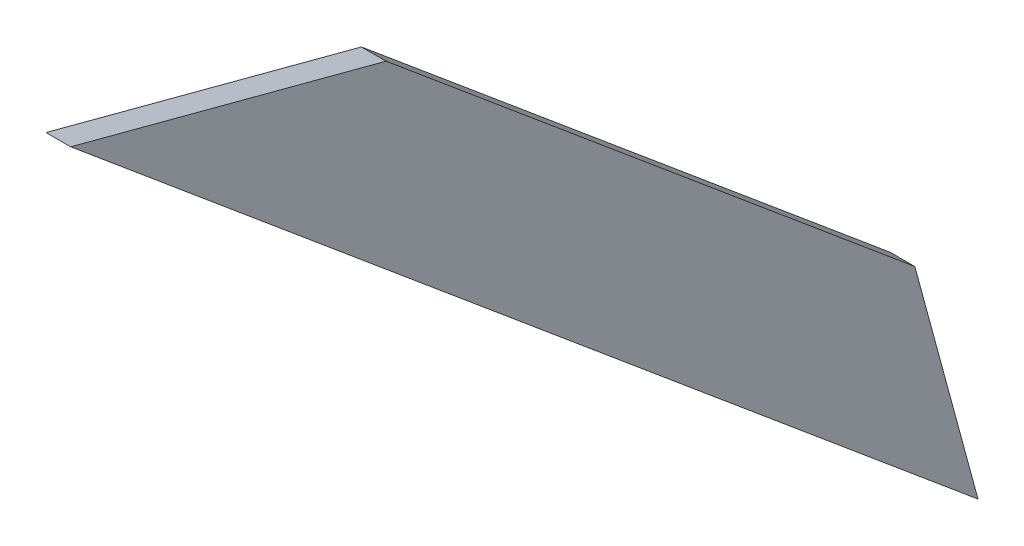
ISO-10303-21;
HEADER;
FILE_DESCRIPTION(('STEP AP214'),'2;1');
FILE_NAME('part.step','',(''),(''),'','','');
FILE_SCHEMA(('AUTOMOTIVE_DESIGN { 1 0 10303 214 1 1 1 1 }'));
ENDSEC;
DATA;
#1=APPLICATION_CONTEXT('core data for automotive mechanical design processes');
#2=APPLICATION_PROTOCOL_DEFINITION('international standard','automotive_design',2000,#1);
#3=PRODUCT_CONTEXT('',#1,'mechanical');
#4=PRODUCT('Part','Part','',(#3));
#5=PRODUCT_RELATED_PRODUCT_CATEGORY('part','',(#4));
#6=PRODUCT_DEFINITION_FORMATION('','',#4);
#7=PRODUCT_DEFINITION_CONTEXT('part definition',#1,'design');
#8=PRODUCT_DEFINITION('design','',#6,#7);
#9=PRODUCT_DEFINITION_SHAPE('','',#8);
#10=(LENGTH_UNIT() NAMED_UNIT(*) SI_UNIT(.MILLI.,.METRE.));
#11=(NAMED_UNIT(*) PLANE_ANGLE_UNIT() SI_UNIT($,.RADIAN.));
#12=(NAMED_UNIT(*) SI_UNIT($,.STERADIAN.) SOLID_ANGLE_UNIT());
#13=UNCERTAINTY_MEASURE_WITH_UNIT(LENGTH_MEASURE(1.E-05),#10,'distance_accuracy_value','');
#14=(GEOMETRIC_REPRESENTATION_CONTEXT(3) GLOBAL_UNCERTAINTY_ASSIGNED_CONTEXT((#13)) GLOBAL_UNIT_ASSIGNED_CONTEXT((#10,
#11,#12)) REPRESENTATION_CONTEXT('',''));
#15=CARTESIAN_POINT('',(0.,0.,0.));
#16=DIRECTION('',(0.,0.,1.));
#17=DIRECTION('',(1.,0.,0.));
#18=AXIS2_PLACEMENT_3D('',#15,#16,#17);
#19=CARTESIAN_POINT('',(-12.6622448824479,250.643987544878,583.742363785169));
#20=DIRECTION('',(0.,0.261586153001389,-0.965180130627405));
#21=DIRECTION('',(0.,0.965180130627405,0.261586153001389));
#22=AXIS2_PLACEMENT_3D('',#19,#20,#21);
#23=PLANE('',#22);
#24=DIRECTION('',(0.,-0.965180130627405,-0.261586153001389));
#25=VECTOR('',#24,1.);
#26=CARTESIAN_POINT('',(-17.6622448824479,250.643987544878,583.742363785169));
#27=LINE('',#26,#25);
#28=CARTESIAN_POINT('',(-17.6622448824479,297.840110343666,596.533605344909));
#29=VERTEX_POINT('',#28);
#30=CARTESIAN_POINT('',(-17.6622448824479,250.643987544878,583.742363785169));
#31=VERTEX_POINT('',#30);
#32=EDGE_CURVE('E97',#29,#31,#27,.T.);
#33=ORIENTED_EDGE('',*,*,#32,.F.);
#34=DIRECTION('',(-1.,0.,0.));
#35=VECTOR('',#34,1.);
#36=CARTESIAN_POINT('',(-12.6622448824479,297.840110343666,596.533605344909));
#37=LINE('',#36,#35);
#38=CARTESIAN_POINT('',(-12.6622448824479,297.840110343666,596.533605344909));
#39=VERTEX_POINT('',#38);
#40=EDGE_CURVE('E11',#39,#29,#37,.T.);
#41=ORIENTED_EDGE('',*,*,#40,.F.);
#42=DIRECTION('',(0.,-0.965180130627405,-0.261586153001389));
#43=VECTOR('',#42,1.);
#44=CARTESIAN_POINT('',(-12.6622448824479,250.643987544878,583.742363785169));
#45=LINE('',#44,#43);
#46=CARTESIAN_POINT('',(-12.6622448824479,250.643987544878,583.742363785169));
#47=VERTEX_POINT('',#46);
#48=EDGE_CURVE('E91',#39,#47,#45,.T.);
#49=ORIENTED_EDGE('',*,*,#48,.T.);
#50=DIRECTION('',(-1.,0.,0.));
#51=VECTOR('',#50,1.);
#52=CARTESIAN_POINT('',(-12.6622448824479,250.643987544878,583.742363785169));
#53=LINE('',#52,#51);
#54=EDGE_CURVE('E36',#47,#31,#53,.T.);
#55=ORIENTED_EDGE('',*,*,#54,.T.);
#56=EDGE_LOOP('',(#33,#41,#49,#55));
#57=FACE_BOUND('',#56,.T.);
#58=ADVANCED_FACE('F33',(#57),#23,.T.);
#59=CARTESIAN_POINT('',(-12.6622448824479,297.840110343666,596.533605344909));
#60=DIRECTION('',(0.,0.767128611531678,-0.641493330728761));
#61=DIRECTION('',(0.,0.641493330728761,0.767128611531678));
#62=AXIS2_PLACEMENT_3D('',#59,#60,#61);
#63=PLANE('',#62);
#64=DIRECTION('',(0.,-0.641493330728761,-0.767128611531678));
#65=VECTOR('',#64,1.);
#66=CARTESIAN_POINT('',(-17.6622448824479,297.840110343666,596.533605344909));
#67=LINE('',#66,#65);
#68=CARTESIAN_POINT('',(-17.6622448824479,387.401634034338,703.635587585995));
#69=VERTEX_POINT('',#68);
#70=EDGE_CURVE('E93',#69,#29,#67,.T.);
#71=ORIENTED_EDGE('',*,*,#70,.F.);
#72=DIRECTION('',(-1.,0.,0.));
#73=VECTOR('',#72,1.);
#74=CARTESIAN_POINT('',(-12.6622448824479,387.401634034338,703.635587585995));
#75=LINE('',#74,#73);
#76=CARTESIAN_POINT('',(-12.6622448824479,387.401634034338,703.635587585995));
#77=VERTEX_POINT('',#76);
#78=EDGE_CURVE('E42',#77,#69,#75,.T.);
#79=ORIENTED_EDGE('',*,*,#78,.F.);
#80=DIRECTION('',(0.,-0.641493330728761,-0.767128611531678));
#81=VECTOR('',#80,1.);
#82=CARTESIAN_POINT('',(-12.6622448824479,297.840110343666,596.533605344909));
#83=LINE('',#82,#81);
#84=EDGE_CURVE('E88',#77,#39,#83,.T.);
#85=ORIENTED_EDGE('',*,*,#84,.T.);
#86=ORIENTED_EDGE('',*,*,#40,.T.);
#87=EDGE_LOOP('',(#71,#79,#85,#86));
#88=FACE_BOUND('',#87,.T.);
#89=ADVANCED_FACE('F107',(#88),#63,.T.);
#90=CARTESIAN_POINT('',(-12.6622448824479,404.323150916461,767.519306695337));
#91=DIRECTION('',(0.,0.966663588852357,-0.256049811534946));
#92=DIRECTION('',(0.,0.256049811534946,0.966663588852357));
#93=AXIS2_PLACEMENT_3D('',#90,#91,#92);
#94=PLANE('',#93);
#95=DIRECTION('',(0.,-0.256049811534946,-0.966663588852357));
#96=VECTOR('',#95,1.);
#97=CARTESIAN_POINT('',(-17.6622448824479,404.323150916461,767.519306695337));
#98=LINE('',#97,#96);
#99=CARTESIAN_POINT('',(-17.6622448824479,404.323150916461,767.519306695337));
#100=VERTEX_POINT('',#99);
#101=EDGE_CURVE('E83',#100,#69,#98,.T.);
#102=ORIENTED_EDGE('',*,*,#101,.F.);
#103=DIRECTION('',(-1.,0.,0.));
#104=VECTOR('',#103,1.);
#105=CARTESIAN_POINT('',(-12.6622448824479,404.323150916461,767.519306695337));
#106=LINE('',#105,#104);
#107=CARTESIAN_POINT('',(-12.6622448824479,404.323150916461,767.519306695337));
#108=VERTEX_POINT('',#107);
#109=EDGE_CURVE('E78',#108,#100,#106,.T.);
#110=ORIENTED_EDGE('',*,*,#109,.F.);
#111=DIRECTION('',(0.,-0.256049811534946,-0.966663588852357));
#112=VECTOR('',#111,1.);
#113=CARTESIAN_POINT('',(-12.6622448824479,404.323150916461,767.519306695337));
#114=LINE('',#113,#112);
#115=EDGE_CURVE('E81',#108,#77,#114,.T.);
#116=ORIENTED_EDGE('',*,*,#115,.T.);
#117=ORIENTED_EDGE('',*,*,#78,.T.);
#118=EDGE_LOOP('',(#102,#110,#116,#117));
#119=FACE_BOUND('',#118,.T.);
#120=ADVANCED_FACE('F80',(#119),#94,.T.);
#121=CARTESIAN_POINT('',(-12.6622448824479,250.643987544878,583.742363785169));
#122=DIRECTION('',(0.,-0.767128611531678,0.641493330728761));
#123=DIRECTION('',(0.,-0.641493330728761,-0.767128611531678));
#124=AXIS2_PLACEMENT_3D('',#121,#122,#123);
#125=PLANE('',#124);
#126=DIRECTION('',(0.,0.641493330728761,0.767128611531678));
#127=VECTOR('',#126,1.);
#128=CARTESIAN_POINT('',(-17.6622448824479,250.643987544878,583.742363785169));
#129=LINE('',#128,#127);
#130=EDGE_CURVE('E100',#31,#100,#129,.T.);
#131=ORIENTED_EDGE('',*,*,#130,.F.);
#132=ORIENTED_EDGE('',*,*,#54,.F.);
#133=DIRECTION('',(0.,0.641493330728761,0.767128611531678));
#134=VECTOR('',#133,1.);
#135=CARTESIAN_POINT('',(-12.6622448824479,250.643987544878,583.742363785169));
#136=LINE('',#135,#134);
#137=EDGE_CURVE('E87',#47,#108,#136,.T.);
#138=ORIENTED_EDGE('',*,*,#137,.T.);
#139=ORIENTED_EDGE('',*,*,#109,.T.);
#140=EDGE_LOOP('',(#131,#132,#138,#139));
#141=FACE_BOUND('',#140,.T.);
#142=ADVANCED_FACE('F90',(#141),#125,.T.);
#143=CARTESIAN_POINT('',(-12.6622448824478,0.,0.));
#144=DIRECTION('',(-1.,0.,0.));
#145=DIRECTION('',(0.,-1.,0.));
#146=AXIS2_PLACEMENT_3D('',#143,#144,#145);
#147=PLANE('',#146);
#148=ORIENTED_EDGE('',*,*,#48,.F.);
#149=ORIENTED_EDGE('',*,*,#84,.F.);
#150=ORIENTED_EDGE('',*,*,#115,.F.);
#151=ORIENTED_EDGE('',*,*,#137,.F.);
#152=EDGE_LOOP('',(#148,#149,#150,#151));
#153=FACE_BOUND('',#152,.T.);
#154=ADVANCED_FACE('F86',(#153),#147,.F.);
#155=CARTESIAN_POINT('',(-17.6622448824478,0.,0.));
#156=DIRECTION('',(-1.,0.,0.));
#157=DIRECTION('',(0.,-1.,0.));
#158=AXIS2_PLACEMENT_3D('',#155,#156,#157);
#159=PLANE('',#158);
#160=ORIENTED_EDGE('',*,*,#32,.T.);
#161=ORIENTED_EDGE('',*,*,#130,.T.);
#162=ORIENTED_EDGE('',*,*,#101,.T.);
#163=ORIENTED_EDGE('',*,*,#70,.T.);
#164=EDGE_LOOP('',(#160,#161,#162,#163));
#165=FACE_BOUND('',#164,.T.);
#166=ADVANCED_FACE('F106',(#165),#159,.T.);
#167=CLOSED_SHELL('',(#58,#89,#120,#142,#154,#166));
#168=MANIFOLD_SOLID_BREP('B2',#167);
#169=ADVANCED_BREP_SHAPE_REPRESENTATION('',(#18,#168),#14);
#170=SHAPE_DEFINITION_REPRESENTATION(#9,#169);
ENDSEC;
END-ISO-10303-21;
